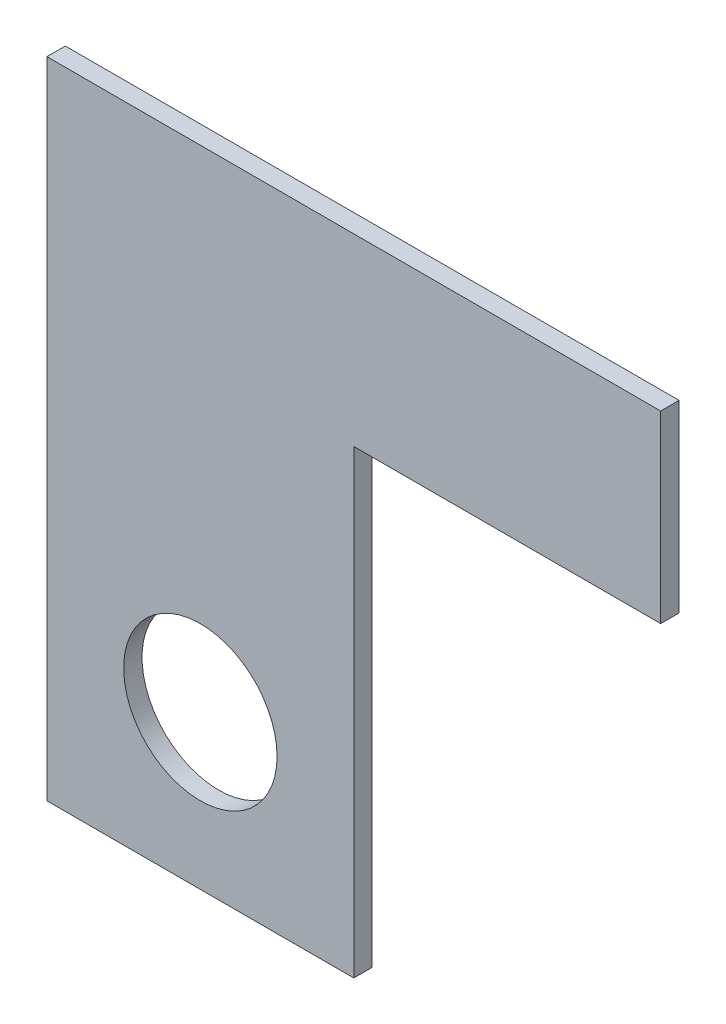
ISO-10303-21;
HEADER;
FILE_DESCRIPTION(('STEP AP214'),'2;1');
FILE_NAME('part.step','',(''),(''),'','','');
FILE_SCHEMA(('AUTOMOTIVE_DESIGN { 1 0 10303 214 1 1 1 1 }'));
ENDSEC;
DATA;
#1=APPLICATION_CONTEXT('core data for automotive mechanical design processes');
#2=APPLICATION_PROTOCOL_DEFINITION('international standard','automotive_design',2000,#1);
#3=PRODUCT_CONTEXT('',#1,'mechanical');
#4=PRODUCT('Part','Part','',(#3));
#5=PRODUCT_RELATED_PRODUCT_CATEGORY('part','',(#4));
#6=PRODUCT_DEFINITION_FORMATION('','',#4);
#7=PRODUCT_DEFINITION_CONTEXT('part definition',#1,'design');
#8=PRODUCT_DEFINITION('design','',#6,#7);
#9=PRODUCT_DEFINITION_SHAPE('','',#8);
#10=(LENGTH_UNIT() NAMED_UNIT(*) SI_UNIT(.MILLI.,.METRE.));
#11=(NAMED_UNIT(*) PLANE_ANGLE_UNIT() SI_UNIT($,.RADIAN.));
#12=(NAMED_UNIT(*) SI_UNIT($,.STERADIAN.) SOLID_ANGLE_UNIT());
#13=UNCERTAINTY_MEASURE_WITH_UNIT(LENGTH_MEASURE(1.E-05),#10,'distance_accuracy_value','');
#14=(GEOMETRIC_REPRESENTATION_CONTEXT(3) GLOBAL_UNCERTAINTY_ASSIGNED_CONTEXT((#13)) GLOBAL_UNIT_ASSIGNED_CONTEXT((#10,
#11,#12)) REPRESENTATION_CONTEXT('',''));
#15=CARTESIAN_POINT('',(0.,0.,0.));
#16=DIRECTION('',(0.,0.,1.));
#17=DIRECTION('',(1.,0.,0.));
#18=AXIS2_PLACEMENT_3D('',#15,#16,#17);
#19=CARTESIAN_POINT('',(0.,0.,3.));
#20=DIRECTION('',(1.,0.,0.));
#21=DIRECTION('',(0.,1.,0.));
#22=AXIS2_PLACEMENT_3D('',#19,#20,#21);
#23=PLANE('',#22);
#24=DIRECTION('',(0.,-1.,0.));
#25=VECTOR('',#24,1.);
#26=CARTESIAN_POINT('',(0.,0.,0.));
#27=LINE('',#26,#25);
#28=CARTESIAN_POINT('',(0.,-15.,0.));
#29=VERTEX_POINT('',#28);
#30=CARTESIAN_POINT('',(0.,-90.,0.));
#31=VERTEX_POINT('',#30);
#32=EDGE_CURVE('E137',#29,#31,#27,.T.);
#33=ORIENTED_EDGE('',*,*,#32,.F.);
#34=DIRECTION('',(0.,0.,-1.));
#35=VECTOR('',#34,1.);
#36=CARTESIAN_POINT('',(0.,-15.,3.));
#37=LINE('',#36,#35);
#38=CARTESIAN_POINT('',(0.,-15.,3.));
#39=VERTEX_POINT('',#38);
#40=EDGE_CURVE('E11',#39,#29,#37,.T.);
#41=ORIENTED_EDGE('',*,*,#40,.F.);
#42=DIRECTION('',(0.,-1.,0.));
#43=VECTOR('',#42,1.);
#44=CARTESIAN_POINT('',(0.,0.,3.));
#45=LINE('',#44,#43);
#46=CARTESIAN_POINT('',(0.,-90.,3.));
#47=VERTEX_POINT('',#46);
#48=EDGE_CURVE('E197',#39,#47,#45,.T.);
#49=ORIENTED_EDGE('',*,*,#48,.T.);
#50=DIRECTION('',(0.,0.,-1.));
#51=VECTOR('',#50,1.);
#52=CARTESIAN_POINT('',(0.,-90.,3.));
#53=LINE('',#52,#51);
#54=EDGE_CURVE('E88',#47,#31,#53,.T.);
#55=ORIENTED_EDGE('',*,*,#54,.T.);
#56=EDGE_LOOP('',(#33,#41,#49,#55));
#57=FACE_BOUND('',#56,.T.);
#58=ADVANCED_FACE('F41',(#57),#23,.T.);
#59=CARTESIAN_POINT('',(0.,-15.,3.));
#60=DIRECTION('',(0.,1.,0.));
#61=DIRECTION('',(0.,0.,1.));
#62=AXIS2_PLACEMENT_3D('',#59,#60,#61);
#63=PLANE('',#62);
#64=DIRECTION('',(1.,0.,0.));
#65=VECTOR('',#64,1.);
#66=CARTESIAN_POINT('',(0.,-15.,0.));
#67=LINE('',#66,#65);
#68=CARTESIAN_POINT('',(50.,-15.,0.));
#69=VERTEX_POINT('',#68);
#70=EDGE_CURVE('E140',#29,#69,#67,.T.);
#71=ORIENTED_EDGE('',*,*,#70,.T.);
#72=DIRECTION('',(0.,0.,-1.));
#73=VECTOR('',#72,1.);
#74=CARTESIAN_POINT('',(50.,-15.,3.));
#75=LINE('',#74,#73);
#76=CARTESIAN_POINT('',(50.,-15.,3.));
#77=VERTEX_POINT('',#76);
#78=EDGE_CURVE('E51',#77,#69,#75,.T.);
#79=ORIENTED_EDGE('',*,*,#78,.F.);
#80=DIRECTION('',(1.,0.,0.));
#81=VECTOR('',#80,1.);
#82=CARTESIAN_POINT('',(0.,-15.,3.));
#83=LINE('',#82,#81);
#84=EDGE_CURVE('E127',#39,#77,#83,.T.);
#85=ORIENTED_EDGE('',*,*,#84,.F.);
#86=ORIENTED_EDGE('',*,*,#40,.T.);
#87=EDGE_LOOP('',(#71,#79,#85,#86));
#88=FACE_BOUND('',#87,.T.);
#89=ADVANCED_FACE('F168',(#88),#63,.F.);
#90=CARTESIAN_POINT('',(50.,0.,3.));
#91=DIRECTION('',(-1.,0.,0.));
#92=DIRECTION('',(0.,0.,1.));
#93=AXIS2_PLACEMENT_3D('',#90,#91,#92);
#94=PLANE('',#93);
#95=DIRECTION('',(0.,1.,0.));
#96=VECTOR('',#95,1.);
#97=CARTESIAN_POINT('',(50.,0.,0.));
#98=LINE('',#97,#96);
#99=CARTESIAN_POINT('',(50.,15.,0.));
#100=VERTEX_POINT('',#99);
#101=EDGE_CURVE('E144',#69,#100,#98,.T.);
#102=ORIENTED_EDGE('',*,*,#101,.T.);
#103=DIRECTION('',(0.,0.,-1.));
#104=VECTOR('',#103,1.);
#105=CARTESIAN_POINT('',(50.,15.,3.));
#106=LINE('',#105,#104);
#107=CARTESIAN_POINT('',(50.,15.,3.));
#108=VERTEX_POINT('',#107);
#109=EDGE_CURVE('E112',#108,#100,#106,.T.);
#110=ORIENTED_EDGE('',*,*,#109,.F.);
#111=DIRECTION('',(0.,1.,0.));
#112=VECTOR('',#111,1.);
#113=CARTESIAN_POINT('',(50.,0.,3.));
#114=LINE('',#113,#112);
#115=EDGE_CURVE('E122',#77,#108,#114,.T.);
#116=ORIENTED_EDGE('',*,*,#115,.F.);
#117=ORIENTED_EDGE('',*,*,#78,.T.);
#118=EDGE_LOOP('',(#102,#110,#116,#117));
#119=FACE_BOUND('',#118,.T.);
#120=ADVANCED_FACE('F165',(#119),#94,.F.);
#121=CARTESIAN_POINT('',(0.,15.,3.));
#122=DIRECTION('',(0.,1.,0.));
#123=DIRECTION('',(0.,0.,1.));
#124=AXIS2_PLACEMENT_3D('',#121,#122,#123);
#125=PLANE('',#124);
#126=DIRECTION('',(1.,0.,0.));
#127=VECTOR('',#126,1.);
#128=CARTESIAN_POINT('',(0.,15.,0.));
#129=LINE('',#128,#127);
#130=CARTESIAN_POINT('',(-50.,15.,0.));
#131=VERTEX_POINT('',#130);
#132=EDGE_CURVE('E108',#131,#100,#129,.T.);
#133=ORIENTED_EDGE('',*,*,#132,.F.);
#134=DIRECTION('',(0.,0.,-1.));
#135=VECTOR('',#134,1.);
#136=CARTESIAN_POINT('',(-50.,15.,3.));
#137=LINE('',#136,#135);
#138=CARTESIAN_POINT('',(-50.,15.,3.));
#139=VERTEX_POINT('',#138);
#140=EDGE_CURVE('E102',#139,#131,#137,.T.);
#141=ORIENTED_EDGE('',*,*,#140,.F.);
#142=DIRECTION('',(1.,0.,0.));
#143=VECTOR('',#142,1.);
#144=CARTESIAN_POINT('',(0.,15.,3.));
#145=LINE('',#144,#143);
#146=EDGE_CURVE('E106',#139,#108,#145,.T.);
#147=ORIENTED_EDGE('',*,*,#146,.T.);
#148=ORIENTED_EDGE('',*,*,#109,.T.);
#149=EDGE_LOOP('',(#133,#141,#147,#148));
#150=FACE_BOUND('',#149,.T.);
#151=ADVANCED_FACE('F104',(#150),#125,.T.);
#152=CARTESIAN_POINT('',(-50.,0.,3.));
#153=DIRECTION('',(1.,0.,0.));
#154=DIRECTION('',(0.,1.,0.));
#155=AXIS2_PLACEMENT_3D('',#152,#153,#154);
#156=PLANE('',#155);
#157=DIRECTION('',(0.,-1.,0.));
#158=VECTOR('',#157,1.);
#159=CARTESIAN_POINT('',(-50.,0.,0.));
#160=LINE('',#159,#158);
#161=CARTESIAN_POINT('',(-50.,-90.,0.));
#162=VERTEX_POINT('',#161);
#163=EDGE_CURVE('E150',#131,#162,#160,.T.);
#164=ORIENTED_EDGE('',*,*,#163,.T.);
#165=DIRECTION('',(0.,0.,-1.));
#166=VECTOR('',#165,1.);
#167=CARTESIAN_POINT('',(-50.,-90.,3.));
#168=LINE('',#167,#166);
#169=CARTESIAN_POINT('',(-50.,-90.,3.));
#170=VERTEX_POINT('',#169);
#171=EDGE_CURVE('E113',#170,#162,#168,.T.);
#172=ORIENTED_EDGE('',*,*,#171,.F.);
#173=DIRECTION('',(0.,-1.,0.));
#174=VECTOR('',#173,1.);
#175=CARTESIAN_POINT('',(-50.,0.,3.));
#176=LINE('',#175,#174);
#177=EDGE_CURVE('E116',#139,#170,#176,.T.);
#178=ORIENTED_EDGE('',*,*,#177,.F.);
#179=ORIENTED_EDGE('',*,*,#140,.T.);
#180=EDGE_LOOP('',(#164,#172,#178,#179));
#181=FACE_BOUND('',#180,.T.);
#182=ADVANCED_FACE('F117',(#181),#156,.F.);
#183=CARTESIAN_POINT('',(-25.,-65.,3.));
#184=DIRECTION('',(0.,0.,-1.));
#185=DIRECTION('',(-1.,0.,0.));
#186=AXIS2_PLACEMENT_3D('',#183,#184,#185);
#187=CYLINDRICAL_SURFACE('',#186,12.5);
#188=CARTESIAN_POINT('',(-25.,-65.,3.));
#189=DIRECTION('',(0.,0.,1.));
#190=DIRECTION('',(1.,0.,0.));
#191=AXIS2_PLACEMENT_3D('',#188,#189,#190);
#192=CIRCLE('',#191,12.5);
#193=CARTESIAN_POINT('',(-12.5,-65.,3.));
#194=VERTEX_POINT('',#193);
#195=EDGE_CURVE('E155',#194,#194,#192,.T.);
#196=ORIENTED_EDGE('',*,*,#195,.T.);
#197=EDGE_LOOP('',(#196));
#198=FACE_BOUND('',#197,.T.);
#199=CARTESIAN_POINT('',(-25.,-65.,0.));
#200=DIRECTION('',(0.,0.,1.));
#201=DIRECTION('',(1.,0.,0.));
#202=AXIS2_PLACEMENT_3D('',#199,#200,#201);
#203=CIRCLE('',#202,12.5);
#204=CARTESIAN_POINT('',(-12.5,-65.,0.));
#205=VERTEX_POINT('',#204);
#206=EDGE_CURVE('E133',#205,#205,#203,.T.);
#207=ORIENTED_EDGE('',*,*,#206,.F.);
#208=EDGE_LOOP('',(#207));
#209=FACE_BOUND('',#208,.T.);
#210=ADVANCED_FACE('F43',(#198,#209),#187,.F.);
#211=CARTESIAN_POINT('',(0.,-90.,3.));
#212=DIRECTION('',(0.,1.,0.));
#213=DIRECTION('',(0.,0.,1.));
#214=AXIS2_PLACEMENT_3D('',#211,#212,#213);
#215=PLANE('',#214);
#216=DIRECTION('',(1.,0.,0.));
#217=VECTOR('',#216,1.);
#218=CARTESIAN_POINT('',(0.,-90.,0.));
#219=LINE('',#218,#217);
#220=EDGE_CURVE('E81',#162,#31,#219,.T.);
#221=ORIENTED_EDGE('',*,*,#220,.T.);
#222=ORIENTED_EDGE('',*,*,#54,.F.);
#223=DIRECTION('',(1.,0.,0.));
#224=VECTOR('',#223,1.);
#225=CARTESIAN_POINT('',(0.,-90.,3.));
#226=LINE('',#225,#224);
#227=EDGE_CURVE('E59',#170,#47,#226,.T.);
#228=ORIENTED_EDGE('',*,*,#227,.F.);
#229=ORIENTED_EDGE('',*,*,#171,.T.);
#230=EDGE_LOOP('',(#221,#222,#228,#229));
#231=FACE_BOUND('',#230,.T.);
#232=ADVANCED_FACE('F182',(#231),#215,.F.);
#233=CARTESIAN_POINT('',(0.,0.,3.));
#234=DIRECTION('',(0.,0.,1.));
#235=DIRECTION('',(1.,0.,0.));
#236=AXIS2_PLACEMENT_3D('',#233,#234,#235);
#237=PLANE('',#236);
#238=ORIENTED_EDGE('',*,*,#195,.F.);
#239=EDGE_LOOP('',(#238));
#240=FACE_BOUND('',#239,.T.);
#241=ORIENTED_EDGE('',*,*,#48,.F.);
#242=ORIENTED_EDGE('',*,*,#84,.T.);
#243=ORIENTED_EDGE('',*,*,#115,.T.);
#244=ORIENTED_EDGE('',*,*,#146,.F.);
#245=ORIENTED_EDGE('',*,*,#177,.T.);
#246=ORIENTED_EDGE('',*,*,#227,.T.);
#247=EDGE_LOOP('',(#241,#242,#243,#244,#245,#246));
#248=FACE_BOUND('',#247,.T.);
#249=ADVANCED_FACE('F120',(#240,#248),#237,.T.);
#250=CARTESIAN_POINT('',(0.,0.,0.));
#251=DIRECTION('',(0.,0.,1.));
#252=DIRECTION('',(1.,0.,0.));
#253=AXIS2_PLACEMENT_3D('',#250,#251,#252);
#254=PLANE('',#253);
#255=ORIENTED_EDGE('',*,*,#206,.T.);
#256=EDGE_LOOP('',(#255));
#257=FACE_BOUND('',#256,.T.);
#258=ORIENTED_EDGE('',*,*,#32,.T.);
#259=ORIENTED_EDGE('',*,*,#220,.F.);
#260=ORIENTED_EDGE('',*,*,#163,.F.);
#261=ORIENTED_EDGE('',*,*,#132,.T.);
#262=ORIENTED_EDGE('',*,*,#101,.F.);
#263=ORIENTED_EDGE('',*,*,#70,.F.);
#264=EDGE_LOOP('',(#258,#259,#260,#261,#262,#263));
#265=FACE_BOUND('',#264,.T.);
#266=ADVANCED_FACE('F169',(#257,#265),#254,.F.);
#267=CLOSED_SHELL('',(#58,#89,#120,#151,#182,#210,#232,#249,#266));
#268=MANIFOLD_SOLID_BREP('B2',#267);
#269=ADVANCED_BREP_SHAPE_REPRESENTATION('',(#18,#268),#14);
#270=SHAPE_DEFINITION_REPRESENTATION(#9,#269);
ENDSEC;
END-ISO-10303-21;
